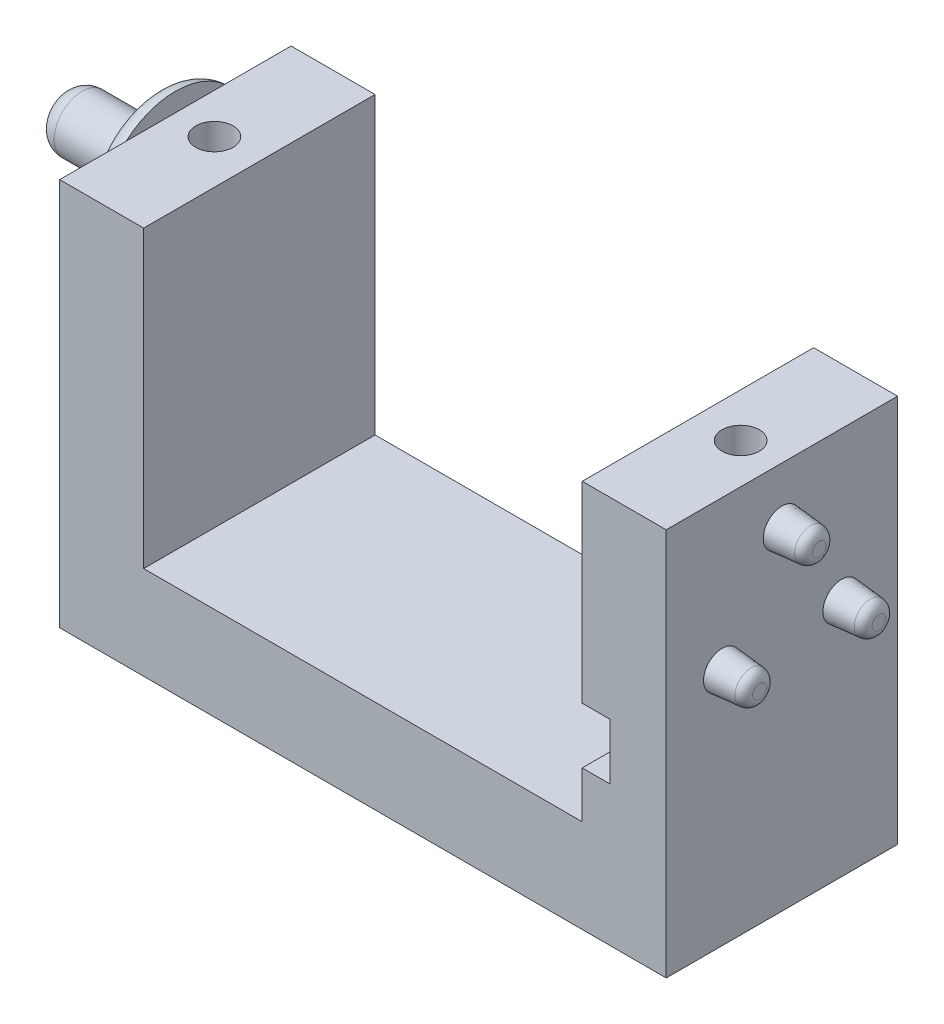
ISO-10303-21;
HEADER;
FILE_DESCRIPTION(('STEP AP214'),'2;1');
FILE_NAME('part.step','',(''),(''),'','','');
FILE_SCHEMA(('AUTOMOTIVE_DESIGN { 1 0 10303 214 1 1 1 1 }'));
ENDSEC;
DATA;
#1=APPLICATION_CONTEXT('core data for automotive mechanical design processes');
#2=APPLICATION_PROTOCOL_DEFINITION('international standard','automotive_design',2000,#1);
#3=PRODUCT_CONTEXT('',#1,'mechanical');
#4=PRODUCT('Part','Part','',(#3));
#5=PRODUCT_RELATED_PRODUCT_CATEGORY('part','',(#4));
#6=PRODUCT_DEFINITION_FORMATION('','',#4);
#7=PRODUCT_DEFINITION_CONTEXT('part definition',#1,'design');
#8=PRODUCT_DEFINITION('design','',#6,#7);
#9=PRODUCT_DEFINITION_SHAPE('','',#8);
#10=(LENGTH_UNIT() NAMED_UNIT(*) SI_UNIT(.MILLI.,.METRE.));
#11=(NAMED_UNIT(*) PLANE_ANGLE_UNIT() SI_UNIT($,.RADIAN.));
#12=(NAMED_UNIT(*) SI_UNIT($,.STERADIAN.) SOLID_ANGLE_UNIT());
#13=UNCERTAINTY_MEASURE_WITH_UNIT(LENGTH_MEASURE(1.E-05),#10,'distance_accuracy_value','');
#14=(GEOMETRIC_REPRESENTATION_CONTEXT(3) GLOBAL_UNCERTAINTY_ASSIGNED_CONTEXT((#13)) GLOBAL_UNIT_ASSIGNED_CONTEXT((#10,
#11,#12)) REPRESENTATION_CONTEXT('',''));
#15=CARTESIAN_POINT('',(0.,0.,0.));
#16=DIRECTION('',(0.,0.,1.));
#17=DIRECTION('',(1.,0.,0.));
#18=AXIS2_PLACEMENT_3D('',#15,#16,#17);
#19=CARTESIAN_POINT('',(11.75,20.8,-6.2));
#20=DIRECTION('',(1.,0.,0.));
#21=DIRECTION('',(0.,0.,-1.));
#22=AXIS2_PLACEMENT_3D('',#19,#20,#21);
#23=PLANE('',#22);
#24=DIRECTION('',(0.,-1.,0.));
#25=VECTOR('',#24,1.);
#26=CARTESIAN_POINT('',(11.75,20.8,6.2));
#27=LINE('',#26,#25);
#28=CARTESIAN_POINT('',(11.75,7.5,6.2));
#29=VERTEX_POINT('',#28);
#30=CARTESIAN_POINT('',(11.75,5.,6.2));
#31=VERTEX_POINT('',#30);
#32=EDGE_CURVE('E215',#29,#31,#27,.T.);
#33=ORIENTED_EDGE('',*,*,#32,.F.);
#34=DIRECTION('',(0.,0.,-1.));
#35=VECTOR('',#34,1.);
#36=CARTESIAN_POINT('',(11.75,7.5,6.2));
#37=LINE('',#36,#35);
#38=CARTESIAN_POINT('',(11.75,7.5,-6.2));
#39=VERTEX_POINT('',#38);
#40=EDGE_CURVE('E177',#29,#39,#37,.T.);
#41=ORIENTED_EDGE('',*,*,#40,.T.);
#42=DIRECTION('',(0.,-1.,0.));
#43=VECTOR('',#42,1.);
#44=CARTESIAN_POINT('',(11.75,20.8,-6.2));
#45=LINE('',#44,#43);
#46=CARTESIAN_POINT('',(11.75,5.,-6.2));
#47=VERTEX_POINT('',#46);
#48=EDGE_CURVE('E199',#39,#47,#45,.T.);
#49=ORIENTED_EDGE('',*,*,#48,.T.);
#50=DIRECTION('',(0.,0.,1.));
#51=VECTOR('',#50,1.);
#52=CARTESIAN_POINT('',(11.75,5.,-6.2));
#53=LINE('',#52,#51);
#54=EDGE_CURVE('E219',#47,#31,#53,.T.);
#55=ORIENTED_EDGE('',*,*,#54,.T.);
#56=EDGE_LOOP('',(#33,#41,#49,#55));
#57=FACE_BOUND('',#56,.T.);
#58=ADVANCED_FACE('F43',(#57),#23,.F.);
#59=CARTESIAN_POINT('',(0.,5.,0.));
#60=DIRECTION('',(0.,1.,0.));
#61=DIRECTION('',(0.,0.,1.));
#62=AXIS2_PLACEMENT_3D('',#59,#60,#61);
#63=PLANE('',#62);
#64=DIRECTION('',(1.,0.,0.));
#65=VECTOR('',#64,1.);
#66=CARTESIAN_POINT('',(-16.25,5.,6.2));
#67=LINE('',#66,#65);
#68=CARTESIAN_POINT('',(-11.75,5.,6.2));
#69=VERTEX_POINT('',#68);
#70=EDGE_CURVE('E267',#69,#31,#67,.T.);
#71=ORIENTED_EDGE('',*,*,#70,.T.);
#72=ORIENTED_EDGE('',*,*,#54,.F.);
#73=DIRECTION('',(-1.,0.,0.));
#74=VECTOR('',#73,1.);
#75=CARTESIAN_POINT('',(-16.25,5.,-6.2));
#76=LINE('',#75,#74);
#77=CARTESIAN_POINT('',(-11.75,5.,-6.2));
#78=VERTEX_POINT('',#77);
#79=EDGE_CURVE('E264',#47,#78,#76,.T.);
#80=ORIENTED_EDGE('',*,*,#79,.T.);
#81=DIRECTION('',(0.,0.,-1.));
#82=VECTOR('',#81,1.);
#83=CARTESIAN_POINT('',(-11.75,5.,-6.2));
#84=LINE('',#83,#82);
#85=EDGE_CURVE('E223',#69,#78,#84,.T.);
#86=ORIENTED_EDGE('',*,*,#85,.F.);
#87=EDGE_LOOP('',(#71,#72,#80,#86));
#88=FACE_BOUND('',#87,.T.);
#89=ADVANCED_FACE('F357',(#88),#63,.T.);
#90=CARTESIAN_POINT('',(16.25,5.,-6.2));
#91=DIRECTION('',(-1.,0.,0.));
#92=DIRECTION('',(0.,0.,1.));
#93=AXIS2_PLACEMENT_3D('',#90,#91,#92);
#94=PLANE('',#93);
#95=CARTESIAN_POINT('',(16.25,12.8,3.2));
#96=DIRECTION('',(-1.,0.,0.));
#97=DIRECTION('',(0.,0.,1.));
#98=AXIS2_PLACEMENT_3D('',#95,#96,#97);
#99=CIRCLE('',#98,1.);
#100=CARTESIAN_POINT('',(16.25,12.8,4.2));
#101=VERTEX_POINT('',#100);
#102=EDGE_CURVE('E307',#101,#101,#99,.F.);
#103=ORIENTED_EDGE('',*,*,#102,.F.);
#104=EDGE_LOOP('',(#103));
#105=FACE_BOUND('',#104,.T.);
#106=CARTESIAN_POINT('',(16.25,12.8,-3.2));
#107=DIRECTION('',(-1.,0.,0.));
#108=DIRECTION('',(0.,0.,1.));
#109=AXIS2_PLACEMENT_3D('',#106,#107,#108);
#110=CIRCLE('',#109,1.);
#111=CARTESIAN_POINT('',(16.25,12.8,-2.2));
#112=VERTEX_POINT('',#111);
#113=EDGE_CURVE('E303',#112,#112,#110,.F.);
#114=ORIENTED_EDGE('',*,*,#113,.F.);
#115=EDGE_LOOP('',(#114));
#116=FACE_BOUND('',#115,.T.);
#117=CARTESIAN_POINT('',(16.25,17.8,0.));
#118=DIRECTION('',(-1.,0.,0.));
#119=DIRECTION('',(0.,0.,1.));
#120=AXIS2_PLACEMENT_3D('',#117,#118,#119);
#121=CIRCLE('',#120,1.);
#122=CARTESIAN_POINT('',(16.25,17.8,1.));
#123=VERTEX_POINT('',#122);
#124=EDGE_CURVE('E299',#123,#123,#121,.F.);
#125=ORIENTED_EDGE('',*,*,#124,.F.);
#126=EDGE_LOOP('',(#125));
#127=FACE_BOUND('',#126,.T.);
#128=DIRECTION('',(0.,0.,-1.));
#129=VECTOR('',#128,1.);
#130=CARTESIAN_POINT('',(16.25,0.,-6.2));
#131=LINE('',#130,#129);
#132=CARTESIAN_POINT('',(16.25,0.,6.2));
#133=VERTEX_POINT('',#132);
#134=CARTESIAN_POINT('',(16.25,0.,-6.2));
#135=VERTEX_POINT('',#134);
#136=EDGE_CURVE('E263',#133,#135,#131,.T.);
#137=ORIENTED_EDGE('',*,*,#136,.T.);
#138=DIRECTION('',(0.,-1.,0.));
#139=VECTOR('',#138,1.);
#140=CARTESIAN_POINT('',(16.25,5.,-6.2));
#141=LINE('',#140,#139);
#142=CARTESIAN_POINT('',(16.25,20.8,-6.2));
#143=VERTEX_POINT('',#142);
#144=EDGE_CURVE('E295',#143,#135,#141,.T.);
#145=ORIENTED_EDGE('',*,*,#144,.F.);
#146=DIRECTION('',(0.,0.,-1.));
#147=VECTOR('',#146,1.);
#148=CARTESIAN_POINT('',(16.25,20.8,-6.2));
#149=LINE('',#148,#147);
#150=CARTESIAN_POINT('',(16.25,20.8,6.2));
#151=VERTEX_POINT('',#150);
#152=EDGE_CURVE('E224',#151,#143,#149,.T.);
#153=ORIENTED_EDGE('',*,*,#152,.F.);
#154=DIRECTION('',(0.,-1.,0.));
#155=VECTOR('',#154,1.);
#156=CARTESIAN_POINT('',(16.25,5.,6.2));
#157=LINE('',#156,#155);
#158=EDGE_CURVE('E272',#151,#133,#157,.T.);
#159=ORIENTED_EDGE('',*,*,#158,.T.);
#160=EDGE_LOOP('',(#137,#145,#153,#159));
#161=FACE_BOUND('',#160,.T.);
#162=ADVANCED_FACE('F364',(#105,#116,#127,#161),#94,.F.);
#163=CARTESIAN_POINT('',(-16.25,5.,-6.2));
#164=DIRECTION('',(0.,0.,1.));
#165=DIRECTION('',(1.,0.,0.));
#166=AXIS2_PLACEMENT_3D('',#163,#164,#165);
#167=PLANE('',#166);
#168=ORIENTED_EDGE('',*,*,#48,.F.);
#169=DIRECTION('',(-1.,0.,0.));
#170=VECTOR('',#169,1.);
#171=CARTESIAN_POINT('',(11.75,7.5,-6.2));
#172=LINE('',#171,#170);
#173=CARTESIAN_POINT('',(13.25,7.5,-6.2));
#174=VERTEX_POINT('',#173);
#175=EDGE_CURVE('E165',#174,#39,#172,.T.);
#176=ORIENTED_EDGE('',*,*,#175,.F.);
#177=DIRECTION('',(0.,-1.,0.));
#178=VECTOR('',#177,1.);
#179=CARTESIAN_POINT('',(13.25,10.5,-6.2));
#180=LINE('',#179,#178);
#181=CARTESIAN_POINT('',(13.25,10.5,-6.2));
#182=VERTEX_POINT('',#181);
#183=EDGE_CURVE('E168',#182,#174,#180,.T.);
#184=ORIENTED_EDGE('',*,*,#183,.F.);
#185=DIRECTION('',(1.,0.,0.));
#186=VECTOR('',#185,1.);
#187=CARTESIAN_POINT('',(11.75,10.5,-6.2));
#188=LINE('',#187,#186);
#189=CARTESIAN_POINT('',(11.75,10.5,-6.2));
#190=VERTEX_POINT('',#189);
#191=EDGE_CURVE('E142',#190,#182,#188,.T.);
#192=ORIENTED_EDGE('',*,*,#191,.F.);
#193=CARTESIAN_POINT('',(11.75,20.8,-6.2));
#194=VERTEX_POINT('',#193);
#195=EDGE_CURVE('E211',#194,#190,#45,.T.);
#196=ORIENTED_EDGE('',*,*,#195,.F.);
#197=DIRECTION('',(-1.,0.,0.));
#198=VECTOR('',#197,1.);
#199=CARTESIAN_POINT('',(16.25,20.8,-6.2));
#200=LINE('',#199,#198);
#201=EDGE_CURVE('E231',#143,#194,#200,.T.);
#202=ORIENTED_EDGE('',*,*,#201,.F.);
#203=ORIENTED_EDGE('',*,*,#144,.T.);
#204=DIRECTION('',(-1.,0.,0.));
#205=VECTOR('',#204,1.);
#206=CARTESIAN_POINT('',(-16.25,0.,-6.2));
#207=LINE('',#206,#205);
#208=CARTESIAN_POINT('',(-16.25,0.,-6.2));
#209=VERTEX_POINT('',#208);
#210=EDGE_CURVE('E276',#135,#209,#207,.T.);
#211=ORIENTED_EDGE('',*,*,#210,.T.);
#212=DIRECTION('',(0.,-1.,0.));
#213=VECTOR('',#212,1.);
#214=CARTESIAN_POINT('',(-16.25,5.,-6.2));
#215=LINE('',#214,#213);
#216=CARTESIAN_POINT('',(-16.25,20.8,-6.2));
#217=VERTEX_POINT('',#216);
#218=EDGE_CURVE('E291',#217,#209,#215,.T.);
#219=ORIENTED_EDGE('',*,*,#218,.F.);
#220=DIRECTION('',(-1.,0.,0.));
#221=VECTOR('',#220,1.);
#222=CARTESIAN_POINT('',(-16.25,20.8,-6.2));
#223=LINE('',#222,#221);
#224=CARTESIAN_POINT('',(-11.75,20.8,-6.2));
#225=VERTEX_POINT('',#224);
#226=EDGE_CURVE('E248',#225,#217,#223,.T.);
#227=ORIENTED_EDGE('',*,*,#226,.F.);
#228=DIRECTION('',(0.,-1.,0.));
#229=VECTOR('',#228,1.);
#230=CARTESIAN_POINT('',(-11.75,20.8,-6.2));
#231=LINE('',#230,#229);
#232=EDGE_CURVE('E252',#225,#78,#231,.T.);
#233=ORIENTED_EDGE('',*,*,#232,.T.);
#234=ORIENTED_EDGE('',*,*,#79,.F.);
#235=EDGE_LOOP('',(#168,#176,#184,#192,#196,#202,#203,#211,#219,#227,#233,#234));
#236=FACE_BOUND('',#235,.T.);
#237=ADVANCED_FACE('F388',(#236),#167,.F.);
#238=CARTESIAN_POINT('',(-16.25,5.,-6.2));
#239=DIRECTION('',(1.,0.,0.));
#240=DIRECTION('',(0.,0.,-1.));
#241=AXIS2_PLACEMENT_3D('',#238,#239,#240);
#242=PLANE('',#241);
#243=CARTESIAN_POINT('',(-16.25,17.8,0.));
#244=DIRECTION('',(-1.,0.,0.));
#245=DIRECTION('',(0.,0.,1.));
#246=AXIS2_PLACEMENT_3D('',#243,#244,#245);
#247=CIRCLE('',#246,4.);
#248=CARTESIAN_POINT('',(-16.25,20.8,-2.64575131106459));
#249=VERTEX_POINT('',#248);
#250=CARTESIAN_POINT('',(-16.25,20.8,2.64575131106459));
#251=VERTEX_POINT('',#250);
#252=EDGE_CURVE('E67',#249,#251,#247,.T.);
#253=ORIENTED_EDGE('',*,*,#252,.F.);
#254=DIRECTION('',(0.,0.,1.));
#255=VECTOR('',#254,1.);
#256=CARTESIAN_POINT('',(-16.25,20.8,-6.2));
#257=LINE('',#256,#255);
#258=EDGE_CURVE('E237',#217,#249,#257,.T.);
#259=ORIENTED_EDGE('',*,*,#258,.F.);
#260=ORIENTED_EDGE('',*,*,#218,.T.);
#261=DIRECTION('',(0.,0.,1.));
#262=VECTOR('',#261,1.);
#263=CARTESIAN_POINT('',(-16.25,0.,-6.2));
#264=LINE('',#263,#262);
#265=CARTESIAN_POINT('',(-16.25,0.,6.2));
#266=VERTEX_POINT('',#265);
#267=EDGE_CURVE('E279',#209,#266,#264,.T.);
#268=ORIENTED_EDGE('',*,*,#267,.T.);
#269=DIRECTION('',(0.,-1.,0.));
#270=VECTOR('',#269,1.);
#271=CARTESIAN_POINT('',(-16.25,5.,6.2));
#272=LINE('',#271,#270);
#273=CARTESIAN_POINT('',(-16.25,20.8,6.2));
#274=VERTEX_POINT('',#273);
#275=EDGE_CURVE('E287',#274,#266,#272,.T.);
#276=ORIENTED_EDGE('',*,*,#275,.F.);
#277=EDGE_CURVE('E242',#251,#274,#257,.T.);
#278=ORIENTED_EDGE('',*,*,#277,.F.);
#279=EDGE_LOOP('',(#253,#259,#260,#268,#276,#278));
#280=FACE_BOUND('',#279,.T.);
#281=ADVANCED_FACE('F407',(#280),#242,.F.);
#282=CARTESIAN_POINT('',(-16.25,5.,6.2));
#283=DIRECTION('',(0.,0.,-1.));
#284=DIRECTION('',(-1.,0.,0.));
#285=AXIS2_PLACEMENT_3D('',#282,#283,#284);
#286=PLANE('',#285);
#287=DIRECTION('',(0.,-1.,0.));
#288=VECTOR('',#287,1.);
#289=CARTESIAN_POINT('',(13.25,10.5,6.2));
#290=LINE('',#289,#288);
#291=CARTESIAN_POINT('',(13.25,10.5,6.2));
#292=VERTEX_POINT('',#291);
#293=CARTESIAN_POINT('',(13.25,7.5,6.2));
#294=VERTEX_POINT('',#293);
#295=EDGE_CURVE('E151',#292,#294,#290,.T.);
#296=ORIENTED_EDGE('',*,*,#295,.T.);
#297=DIRECTION('',(-1.,0.,0.));
#298=VECTOR('',#297,1.);
#299=CARTESIAN_POINT('',(11.75,7.5,6.2));
#300=LINE('',#299,#298);
#301=EDGE_CURVE('E157',#294,#29,#300,.T.);
#302=ORIENTED_EDGE('',*,*,#301,.T.);
#303=ORIENTED_EDGE('',*,*,#32,.T.);
#304=ORIENTED_EDGE('',*,*,#70,.F.);
#305=DIRECTION('',(0.,-1.,0.));
#306=VECTOR('',#305,1.);
#307=CARTESIAN_POINT('',(-11.75,20.8,6.2));
#308=LINE('',#307,#306);
#309=CARTESIAN_POINT('',(-11.75,20.8,6.2));
#310=VERTEX_POINT('',#309);
#311=EDGE_CURVE('E259',#310,#69,#308,.T.);
#312=ORIENTED_EDGE('',*,*,#311,.F.);
#313=DIRECTION('',(1.,0.,0.));
#314=VECTOR('',#313,1.);
#315=CARTESIAN_POINT('',(-16.25,20.8,6.2));
#316=LINE('',#315,#314);
#317=EDGE_CURVE('E240',#274,#310,#316,.T.);
#318=ORIENTED_EDGE('',*,*,#317,.F.);
#319=ORIENTED_EDGE('',*,*,#275,.T.);
#320=DIRECTION('',(1.,0.,0.));
#321=VECTOR('',#320,1.);
#322=CARTESIAN_POINT('',(-16.25,0.,6.2));
#323=LINE('',#322,#321);
#324=EDGE_CURVE('E268',#266,#133,#323,.T.);
#325=ORIENTED_EDGE('',*,*,#324,.T.);
#326=ORIENTED_EDGE('',*,*,#158,.F.);
#327=DIRECTION('',(1.,0.,0.));
#328=VECTOR('',#327,1.);
#329=CARTESIAN_POINT('',(16.25,20.8,6.2));
#330=LINE('',#329,#328);
#331=CARTESIAN_POINT('',(11.75,20.8,6.2));
#332=VERTEX_POINT('',#331);
#333=EDGE_CURVE('E218',#332,#151,#330,.T.);
#334=ORIENTED_EDGE('',*,*,#333,.F.);
#335=CARTESIAN_POINT('',(11.75,10.5,6.2));
#336=VERTEX_POINT('',#335);
#337=EDGE_CURVE('E163',#332,#336,#27,.T.);
#338=ORIENTED_EDGE('',*,*,#337,.T.);
#339=DIRECTION('',(1.,0.,0.));
#340=VECTOR('',#339,1.);
#341=CARTESIAN_POINT('',(11.75,10.5,6.2));
#342=LINE('',#341,#340);
#343=EDGE_CURVE('E59',#336,#292,#342,.T.);
#344=ORIENTED_EDGE('',*,*,#343,.T.);
#345=EDGE_LOOP('',(#296,#302,#303,#304,#312,#318,#319,#325,#326,#334,#338,#344));
#346=FACE_BOUND('',#345,.T.);
#347=ADVANCED_FACE('F160',(#346),#286,.F.);
#348=CARTESIAN_POINT('',(0.,0.,0.));
#349=DIRECTION('',(0.,1.,0.));
#350=DIRECTION('',(0.,0.,1.));
#351=AXIS2_PLACEMENT_3D('',#348,#349,#350);
#352=PLANE('',#351);
#353=ORIENTED_EDGE('',*,*,#136,.F.);
#354=ORIENTED_EDGE('',*,*,#324,.F.);
#355=ORIENTED_EDGE('',*,*,#267,.F.);
#356=ORIENTED_EDGE('',*,*,#210,.F.);
#357=EDGE_LOOP('',(#353,#354,#355,#356));
#358=FACE_BOUND('',#357,.T.);
#359=ADVANCED_FACE('F565',(#358),#352,.F.);
#360=CARTESIAN_POINT('',(-11.75,20.8,-6.2));
#361=DIRECTION('',(-1.,0.,0.));
#362=DIRECTION('',(0.,0.,1.));
#363=AXIS2_PLACEMENT_3D('',#360,#361,#362);
#364=PLANE('',#363);
#365=ORIENTED_EDGE('',*,*,#85,.T.);
#366=ORIENTED_EDGE('',*,*,#232,.F.);
#367=DIRECTION('',(0.,0.,-1.));
#368=VECTOR('',#367,1.);
#369=CARTESIAN_POINT('',(-11.75,20.8,-6.2));
#370=LINE('',#369,#368);
#371=EDGE_CURVE('E245',#310,#225,#370,.T.);
#372=ORIENTED_EDGE('',*,*,#371,.F.);
#373=ORIENTED_EDGE('',*,*,#311,.T.);
#374=EDGE_LOOP('',(#365,#366,#372,#373));
#375=FACE_BOUND('',#374,.T.);
#376=ADVANCED_FACE('F380',(#375),#364,.F.);
#377=CARTESIAN_POINT('',(0.,20.8,0.));
#378=DIRECTION('',(0.,1.,0.));
#379=DIRECTION('',(0.,0.,1.));
#380=AXIS2_PLACEMENT_3D('',#377,#378,#379);
#381=PLANE('',#380);
#382=CARTESIAN_POINT('',(-14.1,20.8,0.060000000000001));
#383=DIRECTION('',(0.,1.,0.));
#384=DIRECTION('',(0.,0.,1.));
#385=AXIS2_PLACEMENT_3D('',#382,#383,#384);
#386=CIRCLE('',#385,1.);
#387=CARTESIAN_POINT('',(-14.1,20.8,1.06));
#388=VERTEX_POINT('',#387);
#389=EDGE_CURVE('E204',#388,#388,#386,.T.);
#390=ORIENTED_EDGE('',*,*,#389,.F.);
#391=EDGE_LOOP('',(#390));
#392=FACE_BOUND('',#391,.T.);
#393=ORIENTED_EDGE('',*,*,#258,.T.);
#394=EDGE_CURVE('E241',#249,#251,#257,.T.);
#395=ORIENTED_EDGE('',*,*,#394,.T.);
#396=ORIENTED_EDGE('',*,*,#277,.T.);
#397=ORIENTED_EDGE('',*,*,#317,.T.);
#398=ORIENTED_EDGE('',*,*,#371,.T.);
#399=ORIENTED_EDGE('',*,*,#226,.T.);
#400=EDGE_LOOP('',(#393,#395,#396,#397,#398,#399));
#401=FACE_BOUND('',#400,.T.);
#402=ADVANCED_FACE('F372',(#392,#401),#381,.T.);
#403=ORIENTED_EDGE('',*,*,#195,.T.);
#404=DIRECTION('',(0.,0.,-1.));
#405=VECTOR('',#404,1.);
#406=CARTESIAN_POINT('',(11.75,10.5,6.2));
#407=LINE('',#406,#405);
#408=EDGE_CURVE('E148',#336,#190,#407,.T.);
#409=ORIENTED_EDGE('',*,*,#408,.F.);
#410=ORIENTED_EDGE('',*,*,#337,.F.);
#411=DIRECTION('',(0.,0.,1.));
#412=VECTOR('',#411,1.);
#413=CARTESIAN_POINT('',(11.75,20.8,-6.2));
#414=LINE('',#413,#412);
#415=EDGE_CURVE('E228',#194,#332,#414,.T.);
#416=ORIENTED_EDGE('',*,*,#415,.F.);
#417=EDGE_LOOP('',(#403,#409,#410,#416));
#418=FACE_BOUND('',#417,.T.);
#419=ADVANCED_FACE('F360',(#418),#23,.F.);
#420=CARTESIAN_POINT('',(0.,20.8,0.));
#421=DIRECTION('',(0.,-1.,0.));
#422=DIRECTION('',(0.,0.,-1.));
#423=AXIS2_PLACEMENT_3D('',#420,#421,#422);
#424=PLANE('',#423);
#425=CARTESIAN_POINT('',(14.1,20.8,0.060000000000001));
#426=DIRECTION('',(0.,1.,0.));
#427=DIRECTION('',(0.,0.,1.));
#428=AXIS2_PLACEMENT_3D('',#425,#426,#427);
#429=CIRCLE('',#428,1.);
#430=CARTESIAN_POINT('',(14.1,20.8,1.06));
#431=VERTEX_POINT('',#430);
#432=EDGE_CURVE('E200',#431,#431,#429,.T.);
#433=ORIENTED_EDGE('',*,*,#432,.F.);
#434=EDGE_LOOP('',(#433));
#435=FACE_BOUND('',#434,.T.);
#436=ORIENTED_EDGE('',*,*,#152,.T.);
#437=ORIENTED_EDGE('',*,*,#201,.T.);
#438=ORIENTED_EDGE('',*,*,#415,.T.);
#439=ORIENTED_EDGE('',*,*,#333,.T.);
#440=EDGE_LOOP('',(#436,#437,#438,#439));
#441=FACE_BOUND('',#440,.T.);
#442=ADVANCED_FACE('F371',(#435,#441),#424,.F.);
#443=CARTESIAN_POINT('',(14.1,15.8,0.060000000000001));
#444=DIRECTION('',(0.,1.,0.));
#445=DIRECTION('',(0.,0.,1.));
#446=AXIS2_PLACEMENT_3D('',#443,#444,#445);
#447=CYLINDRICAL_SURFACE('',#446,1.);
#448=CARTESIAN_POINT('',(14.1,15.8,0.060000000000001));
#449=DIRECTION('',(0.,1.,0.));
#450=DIRECTION('',(0.,0.,1.));
#451=AXIS2_PLACEMENT_3D('',#448,#449,#450);
#452=CIRCLE('',#451,1.);
#453=CARTESIAN_POINT('',(14.1,15.8,1.06));
#454=VERTEX_POINT('',#453);
#455=EDGE_CURVE('E195',#454,#454,#452,.T.);
#456=ORIENTED_EDGE('',*,*,#455,.F.);
#457=EDGE_LOOP('',(#456));
#458=FACE_BOUND('',#457,.T.);
#459=ORIENTED_EDGE('',*,*,#432,.T.);
#460=EDGE_LOOP('',(#459));
#461=FACE_BOUND('',#460,.T.);
#462=ADVANCED_FACE('F378',(#458,#461),#447,.F.);
#463=CARTESIAN_POINT('',(14.1,15.8,0.060000000000001));
#464=DIRECTION('',(0.,1.,0.));
#465=DIRECTION('',(0.,0.,1.));
#466=AXIS2_PLACEMENT_3D('',#463,#464,#465);
#467=PLANE('',#466);
#468=ORIENTED_EDGE('',*,*,#455,.T.);
#469=EDGE_LOOP('',(#468));
#470=FACE_BOUND('',#469,.T.);
#471=ADVANCED_FACE('F447',(#470),#467,.T.);
#472=CARTESIAN_POINT('',(-14.1,15.8,0.060000000000001));
#473=DIRECTION('',(0.,1.,0.));
#474=DIRECTION('',(0.,0.,1.));
#475=AXIS2_PLACEMENT_3D('',#472,#473,#474);
#476=CYLINDRICAL_SURFACE('',#475,1.);
#477=CARTESIAN_POINT('',(-14.1,15.8,0.060000000000001));
#478=DIRECTION('',(0.,1.,0.));
#479=DIRECTION('',(0.,0.,1.));
#480=AXIS2_PLACEMENT_3D('',#477,#478,#479);
#481=CIRCLE('',#480,1.);
#482=CARTESIAN_POINT('',(-14.1,15.8,1.06));
#483=VERTEX_POINT('',#482);
#484=EDGE_CURVE('E194',#483,#483,#481,.T.);
#485=ORIENTED_EDGE('',*,*,#484,.F.);
#486=EDGE_LOOP('',(#485));
#487=FACE_BOUND('',#486,.T.);
#488=ORIENTED_EDGE('',*,*,#389,.T.);
#489=EDGE_LOOP('',(#488));
#490=FACE_BOUND('',#489,.T.);
#491=ADVANCED_FACE('F450',(#487,#490),#476,.F.);
#492=CARTESIAN_POINT('',(-14.1,15.8,0.060000000000001));
#493=DIRECTION('',(0.,1.,0.));
#494=DIRECTION('',(0.,0.,1.));
#495=AXIS2_PLACEMENT_3D('',#492,#493,#494);
#496=PLANE('',#495);
#497=ORIENTED_EDGE('',*,*,#484,.T.);
#498=EDGE_LOOP('',(#497));
#499=FACE_BOUND('',#498,.T.);
#500=ADVANCED_FACE('F445',(#499),#496,.T.);
#501=CARTESIAN_POINT('',(16.25,17.8,0.));
#502=DIRECTION('',(-1.,0.,0.));
#503=DIRECTION('',(0.,0.,-1.));
#504=AXIS2_PLACEMENT_3D('',#501,#502,#503);
#505=CONICAL_SURFACE('',#504,1.,0.0872664625997165);
#506=CARTESIAN_POINT('',(17.7935778713738,17.8,0.));
#507=DIRECTION('',(-1.,0.,0.));
#508=DIRECTION('',(0.,0.,1.));
#509=AXIS2_PLACEMENT_3D('',#506,#507,#508);
#510=CIRCLE('',#509,0.864954434985314);
#511=CARTESIAN_POINT('',(17.7935778713738,17.8,0.864954434985314));
#512=VERTEX_POINT('',#511);
#513=EDGE_CURVE('E11',#512,#512,#510,.T.);
#514=ORIENTED_EDGE('',*,*,#513,.T.);
#515=EDGE_LOOP('',(#514));
#516=FACE_BOUND('',#515,.T.);
#517=ORIENTED_EDGE('',*,*,#124,.T.);
#518=EDGE_LOOP('',(#517));
#519=FACE_BOUND('',#518,.T.);
#520=ADVANCED_FACE('F442',(#516,#519),#505,.T.);
#521=CARTESIAN_POINT('',(18.25,17.8,0.));
#522=DIRECTION('',(1.,0.,0.));
#523=DIRECTION('',(0.,0.,-1.));
#524=AXIS2_PLACEMENT_3D('',#521,#522,#523);
#525=PLANE('',#524);
#526=CARTESIAN_POINT('',(18.25,17.8,0.));
#527=DIRECTION('',(1.,0.,0.));
#528=DIRECTION('',(0.,0.,-1.));
#529=AXIS2_PLACEMENT_3D('',#526,#527,#528);
#530=CIRCLE('',#529,0.366857085939441);
#531=CARTESIAN_POINT('',(18.25,17.8,-0.366857085939441));
#532=VERTEX_POINT('',#531);
#533=EDGE_CURVE('E52',#532,#532,#530,.T.);
#534=ORIENTED_EDGE('',*,*,#533,.T.);
#535=EDGE_LOOP('',(#534));
#536=FACE_BOUND('',#535,.T.);
#537=ADVANCED_FACE('F341',(#536),#525,.T.);
#538=CARTESIAN_POINT('',(16.25,12.8,-3.2));
#539=DIRECTION('',(-1.,0.,0.));
#540=DIRECTION('',(0.,0.,-1.));
#541=AXIS2_PLACEMENT_3D('',#538,#539,#540);
#542=CONICAL_SURFACE('',#541,1.,0.0872664625997165);
#543=CARTESIAN_POINT('',(17.7935778713738,12.8,-3.2));
#544=DIRECTION('',(-1.,0.,0.));
#545=DIRECTION('',(0.,0.,1.));
#546=AXIS2_PLACEMENT_3D('',#543,#544,#545);
#547=CIRCLE('',#546,0.864954434985314);
#548=CARTESIAN_POINT('',(17.7935778713738,12.8,-2.33504556501469));
#549=VERTEX_POINT('',#548);
#550=EDGE_CURVE('E326',#549,#549,#547,.T.);
#551=ORIENTED_EDGE('',*,*,#550,.T.);
#552=EDGE_LOOP('',(#551));
#553=FACE_BOUND('',#552,.T.);
#554=ORIENTED_EDGE('',*,*,#113,.T.);
#555=EDGE_LOOP('',(#554));
#556=FACE_BOUND('',#555,.T.);
#557=ADVANCED_FACE('F433',(#553,#556),#542,.T.);
#558=CARTESIAN_POINT('',(18.25,12.8,-3.2));
#559=DIRECTION('',(1.,0.,0.));
#560=DIRECTION('',(0.,0.,-1.));
#561=AXIS2_PLACEMENT_3D('',#558,#559,#560);
#562=PLANE('',#561);
#563=CARTESIAN_POINT('',(18.25,12.8,-3.2));
#564=DIRECTION('',(1.,0.,0.));
#565=DIRECTION('',(0.,0.,-1.));
#566=AXIS2_PLACEMENT_3D('',#563,#564,#565);
#567=CIRCLE('',#566,0.366857085939441);
#568=CARTESIAN_POINT('',(18.25,12.8,-3.56685708593944));
#569=VERTEX_POINT('',#568);
#570=EDGE_CURVE('E322',#569,#569,#567,.T.);
#571=ORIENTED_EDGE('',*,*,#570,.T.);
#572=EDGE_LOOP('',(#571));
#573=FACE_BOUND('',#572,.T.);
#574=ADVANCED_FACE('F428',(#573),#562,.T.);
#575=CARTESIAN_POINT('',(16.25,12.8,3.2));
#576=DIRECTION('',(-1.,0.,0.));
#577=DIRECTION('',(0.,0.,-1.));
#578=AXIS2_PLACEMENT_3D('',#575,#576,#577);
#579=CONICAL_SURFACE('',#578,1.,0.0872664625997165);
#580=CARTESIAN_POINT('',(17.7935778713738,12.8,3.2));
#581=DIRECTION('',(-1.,0.,0.));
#582=DIRECTION('',(0.,0.,1.));
#583=AXIS2_PLACEMENT_3D('',#580,#581,#582);
#584=CIRCLE('',#583,0.864954434985314);
#585=CARTESIAN_POINT('',(17.7935778713738,12.8,4.06495443498531));
#586=VERTEX_POINT('',#585);
#587=EDGE_CURVE('E334',#586,#586,#584,.T.);
#588=ORIENTED_EDGE('',*,*,#587,.T.);
#589=EDGE_LOOP('',(#588));
#590=FACE_BOUND('',#589,.T.);
#591=ORIENTED_EDGE('',*,*,#102,.T.);
#592=EDGE_LOOP('',(#591));
#593=FACE_BOUND('',#592,.T.);
#594=ADVANCED_FACE('F425',(#590,#593),#579,.T.);
#595=CARTESIAN_POINT('',(18.25,12.8,3.2));
#596=DIRECTION('',(1.,0.,0.));
#597=DIRECTION('',(0.,0.,-1.));
#598=AXIS2_PLACEMENT_3D('',#595,#596,#597);
#599=PLANE('',#598);
#600=CARTESIAN_POINT('',(18.25,12.8,3.2));
#601=DIRECTION('',(1.,0.,0.));
#602=DIRECTION('',(0.,0.,-1.));
#603=AXIS2_PLACEMENT_3D('',#600,#601,#602);
#604=CIRCLE('',#603,0.366857085939441);
#605=CARTESIAN_POINT('',(18.25,12.8,2.83314291406056));
#606=VERTEX_POINT('',#605);
#607=EDGE_CURVE('E330',#606,#606,#604,.T.);
#608=ORIENTED_EDGE('',*,*,#607,.T.);
#609=EDGE_LOOP('',(#608));
#610=FACE_BOUND('',#609,.T.);
#611=ADVANCED_FACE('F421',(#610),#599,.T.);
#612=CARTESIAN_POINT('',(-17.25,17.8,0.));
#613=DIRECTION('',(-1.,0.,0.));
#614=DIRECTION('',(0.,0.,1.));
#615=AXIS2_PLACEMENT_3D('',#612,#613,#614);
#616=PLANE('',#615);
#617=CARTESIAN_POINT('',(-17.25,17.8,0.));
#618=DIRECTION('',(-1.,0.,0.));
#619=DIRECTION('',(0.,0.,1.));
#620=AXIS2_PLACEMENT_3D('',#617,#618,#619);
#621=CIRCLE('',#620,3.);
#622=CARTESIAN_POINT('',(-17.25,17.8,3.));
#623=VERTEX_POINT('',#622);
#624=EDGE_CURVE('E318',#623,#623,#621,.T.);
#625=ORIENTED_EDGE('',*,*,#624,.T.);
#626=EDGE_LOOP('',(#625));
#627=FACE_BOUND('',#626,.T.);
#628=CARTESIAN_POINT('',(-17.25,17.8,0.));
#629=DIRECTION('',(-1.,0.,0.));
#630=DIRECTION('',(0.,0.,1.));
#631=AXIS2_PLACEMENT_3D('',#628,#629,#630);
#632=CIRCLE('',#631,1.5);
#633=CARTESIAN_POINT('',(-17.25,17.8,1.5));
#634=VERTEX_POINT('',#633);
#635=EDGE_CURVE('E186',#634,#634,#632,.T.);
#636=ORIENTED_EDGE('',*,*,#635,.F.);
#637=EDGE_LOOP('',(#636));
#638=FACE_BOUND('',#637,.T.);
#639=ADVANCED_FACE('F412',(#627,#638),#616,.T.);
#640=CARTESIAN_POINT('',(-16.25,17.8,0.));
#641=DIRECTION('',(-1.,0.,0.));
#642=DIRECTION('',(0.,0.,1.));
#643=AXIS2_PLACEMENT_3D('',#640,#641,#642);
#644=PLANE('',#643);
#645=ORIENTED_EDGE('',*,*,#394,.F.);
#646=EDGE_CURVE('E181',#251,#249,#247,.T.);
#647=ORIENTED_EDGE('',*,*,#646,.F.);
#648=EDGE_LOOP('',(#645,#647));
#649=FACE_BOUND('',#648,.T.);
#650=ADVANCED_FACE('F409',(#649),#644,.F.);
#651=CARTESIAN_POINT('',(-22.25,17.8,0.));
#652=DIRECTION('',(1.,0.,0.));
#653=DIRECTION('',(0.,0.,-1.));
#654=AXIS2_PLACEMENT_3D('',#651,#652,#653);
#655=CYLINDRICAL_SURFACE('',#654,1.5);
#656=CARTESIAN_POINT('',(-21.25,17.8,0.));
#657=DIRECTION('',(-1.,0.,0.));
#658=DIRECTION('',(0.,0.,1.));
#659=AXIS2_PLACEMENT_3D('',#656,#657,#658);
#660=CIRCLE('',#659,1.5);
#661=CARTESIAN_POINT('',(-21.25,17.8,1.5));
#662=VERTEX_POINT('',#661);
#663=EDGE_CURVE('E314',#662,#662,#660,.F.);
#664=ORIENTED_EDGE('',*,*,#663,.T.);
#665=EDGE_LOOP('',(#664));
#666=FACE_BOUND('',#665,.T.);
#667=ORIENTED_EDGE('',*,*,#635,.T.);
#668=EDGE_LOOP('',(#667));
#669=FACE_BOUND('',#668,.T.);
#670=ADVANCED_FACE('F411',(#666,#669),#655,.T.);
#671=CARTESIAN_POINT('',(-22.25,17.8,0.));
#672=DIRECTION('',(-1.,0.,0.));
#673=DIRECTION('',(0.,0.,1.));
#674=AXIS2_PLACEMENT_3D('',#671,#672,#673);
#675=PLANE('',#674);
#676=CARTESIAN_POINT('',(-22.25,17.8,0.));
#677=DIRECTION('',(-1.,0.,0.));
#678=DIRECTION('',(0.,0.,1.));
#679=AXIS2_PLACEMENT_3D('',#676,#677,#678);
#680=CIRCLE('',#679,0.5);
#681=CARTESIAN_POINT('',(-22.25,17.8,0.5));
#682=VERTEX_POINT('',#681);
#683=EDGE_CURVE('E190',#682,#682,#680,.T.);
#684=ORIENTED_EDGE('',*,*,#683,.T.);
#685=EDGE_LOOP('',(#684));
#686=FACE_BOUND('',#685,.T.);
#687=ADVANCED_FACE('F418',(#686),#675,.T.);
#688=CARTESIAN_POINT('',(-21.25,17.8,0.));
#689=DIRECTION('',(-1.,0.,0.));
#690=DIRECTION('',(0.,0.,1.));
#691=AXIS2_PLACEMENT_3D('',#688,#689,#690);
#692=DEGENERATE_TOROIDAL_SURFACE('',#691,0.5,1.,.T.);
#693=ORIENTED_EDGE('',*,*,#663,.F.);
#694=EDGE_LOOP('',(#693));
#695=FACE_BOUND('',#694,.T.);
#696=ORIENTED_EDGE('',*,*,#683,.F.);
#697=EDGE_LOOP('',(#696));
#698=FACE_BOUND('',#697,.T.);
#699=ADVANCED_FACE('F515',(#695,#698),#692,.T.);
#700=CARTESIAN_POINT('',(-16.25,17.8,0.));
#701=DIRECTION('',(-1.,0.,0.));
#702=DIRECTION('',(0.,0.,1.));
#703=AXIS2_PLACEMENT_3D('',#700,#701,#702);
#704=TOROIDAL_SURFACE('',#703,3.,1.);
#705=ORIENTED_EDGE('',*,*,#252,.T.);
#706=ORIENTED_EDGE('',*,*,#646,.T.);
#707=EDGE_LOOP('',(#705,#706));
#708=FACE_BOUND('',#707,.T.);
#709=ORIENTED_EDGE('',*,*,#624,.F.);
#710=EDGE_LOOP('',(#709));
#711=FACE_BOUND('',#710,.T.);
#712=ADVANCED_FACE('F400',(#708,#711),#704,.T.);
#713=CARTESIAN_POINT('',(17.75,12.8,-3.2));
#714=DIRECTION('',(1.,0.,0.));
#715=DIRECTION('',(0.,0.,-1.));
#716=AXIS2_PLACEMENT_3D('',#713,#714,#715);
#717=DEGENERATE_TOROIDAL_SURFACE('',#716,0.366857085939441,0.5,.T.);
#718=ORIENTED_EDGE('',*,*,#550,.F.);
#719=EDGE_LOOP('',(#718));
#720=FACE_BOUND('',#719,.T.);
#721=ORIENTED_EDGE('',*,*,#570,.F.);
#722=EDGE_LOOP('',(#721));
#723=FACE_BOUND('',#722,.T.);
#724=ADVANCED_FACE('F353',(#720,#723),#717,.T.);
#725=CARTESIAN_POINT('',(17.75,12.8,3.2));
#726=DIRECTION('',(1.,0.,0.));
#727=DIRECTION('',(0.,0.,-1.));
#728=AXIS2_PLACEMENT_3D('',#725,#726,#727);
#729=DEGENERATE_TOROIDAL_SURFACE('',#728,0.366857085939441,0.5,.T.);
#730=ORIENTED_EDGE('',*,*,#587,.F.);
#731=EDGE_LOOP('',(#730));
#732=FACE_BOUND('',#731,.T.);
#733=ORIENTED_EDGE('',*,*,#607,.F.);
#734=EDGE_LOOP('',(#733));
#735=FACE_BOUND('',#734,.T.);
#736=ADVANCED_FACE('F345',(#732,#735),#729,.T.);
#737=CARTESIAN_POINT('',(17.75,17.8,0.));
#738=DIRECTION('',(1.,0.,0.));
#739=DIRECTION('',(0.,0.,-1.));
#740=AXIS2_PLACEMENT_3D('',#737,#738,#739);
#741=DEGENERATE_TOROIDAL_SURFACE('',#740,0.366857085939441,0.5,.T.);
#742=ORIENTED_EDGE('',*,*,#513,.F.);
#743=EDGE_LOOP('',(#742));
#744=FACE_BOUND('',#743,.T.);
#745=ORIENTED_EDGE('',*,*,#533,.F.);
#746=EDGE_LOOP('',(#745));
#747=FACE_BOUND('',#746,.T.);
#748=ADVANCED_FACE('F45',(#744,#747),#741,.T.);
#749=CARTESIAN_POINT('',(11.75,7.5,6.2));
#750=DIRECTION('',(0.,-1.,0.));
#751=DIRECTION('',(0.,0.,-1.));
#752=AXIS2_PLACEMENT_3D('',#749,#750,#751);
#753=PLANE('',#752);
#754=ORIENTED_EDGE('',*,*,#175,.T.);
#755=ORIENTED_EDGE('',*,*,#40,.F.);
#756=ORIENTED_EDGE('',*,*,#301,.F.);
#757=DIRECTION('',(0.,0.,-1.));
#758=VECTOR('',#757,1.);
#759=CARTESIAN_POINT('',(13.25,7.5,6.2));
#760=LINE('',#759,#758);
#761=EDGE_CURVE('E147',#294,#174,#760,.T.);
#762=ORIENTED_EDGE('',*,*,#761,.T.);
#763=EDGE_LOOP('',(#754,#755,#756,#762));
#764=FACE_BOUND('',#763,.T.);
#765=ADVANCED_FACE('F344',(#764),#753,.F.);
#766=CARTESIAN_POINT('',(13.25,10.5,6.2));
#767=DIRECTION('',(1.,0.,0.));
#768=DIRECTION('',(0.,0.,-1.));
#769=AXIS2_PLACEMENT_3D('',#766,#767,#768);
#770=PLANE('',#769);
#771=ORIENTED_EDGE('',*,*,#183,.T.);
#772=ORIENTED_EDGE('',*,*,#761,.F.);
#773=ORIENTED_EDGE('',*,*,#295,.F.);
#774=DIRECTION('',(0.,0.,-1.));
#775=VECTOR('',#774,1.);
#776=CARTESIAN_POINT('',(13.25,10.5,6.2));
#777=LINE('',#776,#775);
#778=EDGE_CURVE('E138',#292,#182,#777,.T.);
#779=ORIENTED_EDGE('',*,*,#778,.T.);
#780=EDGE_LOOP('',(#771,#772,#773,#779));
#781=FACE_BOUND('',#780,.T.);
#782=ADVANCED_FACE('F152',(#781),#770,.F.);
#783=CARTESIAN_POINT('',(11.75,10.5,6.2));
#784=DIRECTION('',(0.,1.,0.));
#785=DIRECTION('',(0.,0.,1.));
#786=AXIS2_PLACEMENT_3D('',#783,#784,#785);
#787=PLANE('',#786);
#788=ORIENTED_EDGE('',*,*,#191,.T.);
#789=ORIENTED_EDGE('',*,*,#778,.F.);
#790=ORIENTED_EDGE('',*,*,#343,.F.);
#791=ORIENTED_EDGE('',*,*,#408,.T.);
#792=EDGE_LOOP('',(#788,#789,#790,#791));
#793=FACE_BOUND('',#792,.T.);
#794=ADVANCED_FACE('F140',(#793),#787,.F.);
#795=CLOSED_SHELL('',(#58,#89,#162,#237,#281,#347,#359,#376,#402,#419,#442,#462,#471,#491,#500,
#520,#537,#557,#574,#594,#611,#639,#650,#670,#687,#699,#712,#724,#736,#748,#765,#782,#794));
#796=MANIFOLD_SOLID_BREP('B2',#795);
#797=ADVANCED_BREP_SHAPE_REPRESENTATION('',(#18,#796),#14);
#798=SHAPE_DEFINITION_REPRESENTATION(#9,#797);
ENDSEC;
END-ISO-10303-21;
